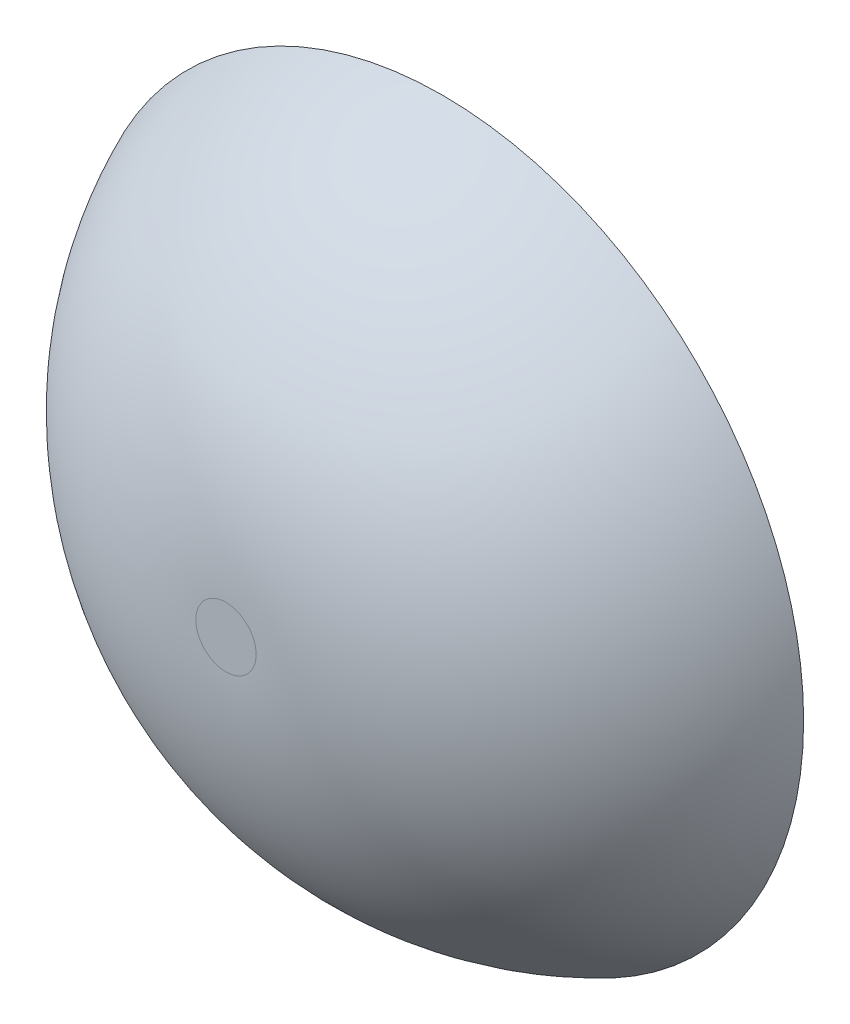
ISO-10303-21;
HEADER;
FILE_DESCRIPTION(('STEP AP214'),'2;1');
FILE_NAME('part.step','',(''),(''),'','','');
FILE_SCHEMA(('AUTOMOTIVE_DESIGN { 1 0 10303 214 1 1 1 1 }'));
ENDSEC;
DATA;
#1=APPLICATION_CONTEXT('core data for automotive mechanical design processes');
#2=APPLICATION_PROTOCOL_DEFINITION('international standard','automotive_design',2000,#1);
#3=PRODUCT_CONTEXT('',#1,'mechanical');
#4=PRODUCT('Part','Part','',(#3));
#5=PRODUCT_RELATED_PRODUCT_CATEGORY('part','',(#4));
#6=PRODUCT_DEFINITION_FORMATION('','',#4);
#7=PRODUCT_DEFINITION_CONTEXT('part definition',#1,'design');
#8=PRODUCT_DEFINITION('design','',#6,#7);
#9=PRODUCT_DEFINITION_SHAPE('','',#8);
#10=(LENGTH_UNIT() NAMED_UNIT(*) SI_UNIT(.MILLI.,.METRE.));
#11=(NAMED_UNIT(*) PLANE_ANGLE_UNIT() SI_UNIT($,.RADIAN.));
#12=(NAMED_UNIT(*) SI_UNIT($,.STERADIAN.) SOLID_ANGLE_UNIT());
#13=UNCERTAINTY_MEASURE_WITH_UNIT(LENGTH_MEASURE(1.E-05),#10,'distance_accuracy_value','');
#14=(GEOMETRIC_REPRESENTATION_CONTEXT(3) GLOBAL_UNCERTAINTY_ASSIGNED_CONTEXT((#13)) GLOBAL_UNIT_ASSIGNED_CONTEXT((#10,
#11,#12)) REPRESENTATION_CONTEXT('',''));
#15=CARTESIAN_POINT('',(0.,0.,0.));
#16=DIRECTION('',(0.,0.,1.));
#17=DIRECTION('',(1.,0.,0.));
#18=AXIS2_PLACEMENT_3D('',#15,#16,#17);
#19=CARTESIAN_POINT('',(0.,0.,3.75));
#20=DIRECTION('',(0.,0.,1.));
#21=DIRECTION('',(1.,0.,0.));
#22=AXIS2_PLACEMENT_3D('',#19,#20,#21);
#23=PLANE('',#22);
#24=CARTESIAN_POINT('',(2.,-2.,3.75));
#25=DIRECTION('',(0.,0.,-1.));
#26=DIRECTION('',(0.,-1.,0.));
#27=AXIS2_PLACEMENT_3D('',#24,#25,#26);
#28=CIRCLE('',#27,0.0417424305044199);
#29=CARTESIAN_POINT('',(2.,-2.04174243050442,3.75));
#30=VERTEX_POINT('',#29);
#31=CARTESIAN_POINT('',(2.,-1.95825756949558,3.75));
#32=VERTEX_POINT('',#31);
#33=EDGE_CURVE('E36',#30,#32,#28,.T.);
#34=ORIENTED_EDGE('',*,*,#33,.F.);
#35=CARTESIAN_POINT('',(2.,-2.,3.75));
#36=DIRECTION('',(0.,0.,-1.));
#37=DIRECTION('',(0.,1.,0.));
#38=AXIS2_PLACEMENT_3D('',#35,#36,#37);
#39=CIRCLE('',#38,0.0417424305044199);
#40=EDGE_CURVE('E27',#32,#30,#39,.T.);
#41=ORIENTED_EDGE('',*,*,#40,.F.);
#42=EDGE_LOOP('',(#34,#41));
#43=FACE_BOUND('',#42,.T.);
#44=ADVANCED_FACE('F17',(#43),#23,.T.);
#45=CARTESIAN_POINT('',(2.,-1.95825756949558,3.25));
#46=DIRECTION('',(-1.,0.,0.));
#47=DIRECTION('',(0.,1.,0.));
#48=AXIS2_PLACEMENT_3D('',#45,#46,#47);
#49=CIRCLE('',#48,0.5);
#50=TRIMMED_CURVE('',#49,(PARAMETER_VALUE(-1.65437847094237)),
(PARAMETER_VALUE(1.65437847094237)),.T.,.PARAMETER.);
#51=CARTESIAN_POINT('',(2.,-2.,3.25));
#52=DIRECTION('',(0.,0.,1.));
#53=AXIS1_PLACEMENT('',#51,#52);
#54=SURFACE_OF_REVOLUTION('',#50,#53);
#55=ORIENTED_EDGE('',*,*,#33,.T.);
#56=ORIENTED_EDGE('',*,*,#40,.T.);
#57=EDGE_LOOP('',(#55,#56));
#58=FACE_BOUND('',#57,.T.);
#59=CARTESIAN_POINT('',(2.,-2.,3.45));
#60=DIRECTION('',(0.,0.,1.));
#61=DIRECTION('',(1.,0.,0.));
#62=AXIS2_PLACEMENT_3D('',#59,#60,#61);
#63=CIRCLE('',#62,0.5);
#64=CARTESIAN_POINT('',(2.5,-2.,3.45));
#65=VERTEX_POINT('',#64);
#66=EDGE_CURVE('E11',#65,#65,#63,.T.);
#67=ORIENTED_EDGE('',*,*,#66,.T.);
#68=EDGE_LOOP('',(#67));
#69=FACE_BOUND('',#68,.T.);
#70=ADVANCED_FACE('F37',(#58,#69),#54,.F.);
#71=CARTESIAN_POINT('',(0.,0.,3.45));
#72=DIRECTION('',(0.,0.,1.));
#73=DIRECTION('',(1.,0.,0.));
#74=AXIS2_PLACEMENT_3D('',#71,#72,#73);
#75=PLANE('',#74);
#76=ORIENTED_EDGE('',*,*,#66,.F.);
#77=EDGE_LOOP('',(#76));
#78=FACE_BOUND('',#77,.T.);
#79=ADVANCED_FACE('F65',(#78),#75,.F.);
#80=CLOSED_SHELL('',(#44,#70,#79));
#81=MANIFOLD_SOLID_BREP('B1',#80);
#82=ADVANCED_BREP_SHAPE_REPRESENTATION('',(#18,#81),#14);
#83=SHAPE_DEFINITION_REPRESENTATION(#9,#82);
ENDSEC;
END-ISO-10303-21;
